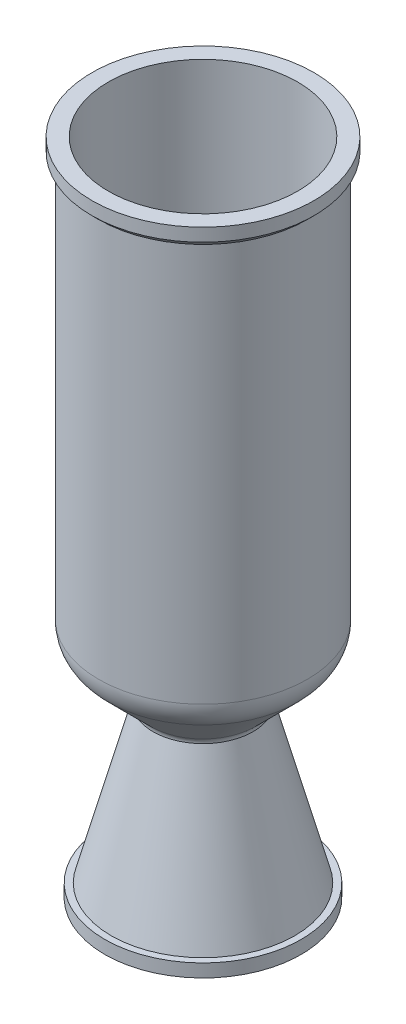
ISO-10303-21;
HEADER;
FILE_DESCRIPTION(('STEP AP214'),'2;1');
FILE_NAME('part.step','',(''),(''),'','','');
FILE_SCHEMA(('AUTOMOTIVE_DESIGN { 1 0 10303 214 1 1 1 1 }'));
ENDSEC;
DATA;
#1=APPLICATION_CONTEXT('core data for automotive mechanical design processes');
#2=APPLICATION_PROTOCOL_DEFINITION('international standard','automotive_design',2000,#1);
#3=PRODUCT_CONTEXT('',#1,'mechanical');
#4=PRODUCT('Part','Part','',(#3));
#5=PRODUCT_RELATED_PRODUCT_CATEGORY('part','',(#4));
#6=PRODUCT_DEFINITION_FORMATION('','',#4);
#7=PRODUCT_DEFINITION_CONTEXT('part definition',#1,'design');
#8=PRODUCT_DEFINITION('design','',#6,#7);
#9=PRODUCT_DEFINITION_SHAPE('','',#8);
#10=(LENGTH_UNIT() NAMED_UNIT(*) SI_UNIT(.MILLI.,.METRE.));
#11=(NAMED_UNIT(*) PLANE_ANGLE_UNIT() SI_UNIT($,.RADIAN.));
#12=(NAMED_UNIT(*) SI_UNIT($,.STERADIAN.) SOLID_ANGLE_UNIT());
#13=UNCERTAINTY_MEASURE_WITH_UNIT(LENGTH_MEASURE(1.E-05),#10,'distance_accuracy_value','');
#14=(GEOMETRIC_REPRESENTATION_CONTEXT(3) GLOBAL_UNCERTAINTY_ASSIGNED_CONTEXT((#13)) GLOBAL_UNIT_ASSIGNED_CONTEXT((#10,
#11,#12)) REPRESENTATION_CONTEXT('',''));
#15=CARTESIAN_POINT('',(0.,0.,0.));
#16=DIRECTION('',(0.,0.,1.));
#17=DIRECTION('',(1.,0.,0.));
#18=AXIS2_PLACEMENT_3D('',#15,#16,#17);
#19=CARTESIAN_POINT('',(-50.8,0.,0.));
#20=DIRECTION('',(0.,-1.,0.));
#21=DIRECTION('',(0.,0.,-1.));
#22=AXIS2_PLACEMENT_3D('',#19,#20,#21);
#23=PLANE('',#22);
#24=CARTESIAN_POINT('',(0.,0.,0.));
#25=DIRECTION('',(0.,-1.,0.));
#26=DIRECTION('',(0.,0.,-1.));
#27=AXIS2_PLACEMENT_3D('',#24,#25,#26);
#28=CIRCLE('',#27,53.975);
#29=CARTESIAN_POINT('',(0.,0.,-53.975));
#30=VERTEX_POINT('',#29);
#31=EDGE_CURVE('E10',#30,#30,#28,.T.);
#32=ORIENTED_EDGE('',*,*,#31,.F.);
#33=EDGE_LOOP('',(#32));
#34=FACE_BOUND('',#33,.T.);
#35=CARTESIAN_POINT('',(0.,0.,0.));
#36=DIRECTION('',(0.,-1.,0.));
#37=DIRECTION('',(0.,0.,-1.));
#38=AXIS2_PLACEMENT_3D('',#35,#36,#37);
#39=CIRCLE('',#38,46.0375);
#40=CARTESIAN_POINT('',(0.,0.,-46.0375));
#41=VERTEX_POINT('',#40);
#42=EDGE_CURVE('E92',#41,#41,#39,.T.);
#43=ORIENTED_EDGE('',*,*,#42,.T.);
#44=EDGE_LOOP('',(#43));
#45=FACE_BOUND('',#44,.T.);
#46=ADVANCED_FACE('F37',(#34,#45),#23,.F.);
#47=CARTESIAN_POINT('',(0.,0.,0.));
#48=DIRECTION('',(0.,-1.,0.));
#49=DIRECTION('',(0.,0.,-1.));
#50=AXIS2_PLACEMENT_3D('',#47,#48,#49);
#51=CYLINDRICAL_SURFACE('',#50,53.975);
#52=CARTESIAN_POINT('',(0.,-6.35,0.));
#53=DIRECTION('',(0.,-1.,0.));
#54=DIRECTION('',(0.,0.,-1.));
#55=AXIS2_PLACEMENT_3D('',#52,#53,#54);
#56=CIRCLE('',#55,53.975);
#57=CARTESIAN_POINT('',(0.,-6.35,-53.975));
#58=VERTEX_POINT('',#57);
#59=EDGE_CURVE('E43',#58,#58,#56,.T.);
#60=ORIENTED_EDGE('',*,*,#59,.F.);
#61=EDGE_LOOP('',(#60));
#62=FACE_BOUND('',#61,.T.);
#63=ORIENTED_EDGE('',*,*,#31,.T.);
#64=EDGE_LOOP('',(#63));
#65=FACE_BOUND('',#64,.T.);
#66=ADVANCED_FACE('F183',(#62,#65),#51,.T.);
#67=CARTESIAN_POINT('',(0.,-6.35,0.));
#68=DIRECTION('',(0.,1.,0.));
#69=DIRECTION('',(0.,0.,1.));
#70=AXIS2_PLACEMENT_3D('',#67,#68,#69);
#71=CONICAL_SURFACE('',#70,53.975,0.78539816339745);
#72=CARTESIAN_POINT('',(0.,-9.52499999999998,0.));
#73=DIRECTION('',(0.,-1.,0.));
#74=DIRECTION('',(0.,0.,-1.));
#75=AXIS2_PLACEMENT_3D('',#72,#73,#74);
#76=CIRCLE('',#75,50.8);
#77=CARTESIAN_POINT('',(0.,-9.52499999999998,-50.8));
#78=VERTEX_POINT('',#77);
#79=EDGE_CURVE('E47',#78,#78,#76,.T.);
#80=ORIENTED_EDGE('',*,*,#79,.F.);
#81=EDGE_LOOP('',(#80));
#82=FACE_BOUND('',#81,.T.);
#83=ORIENTED_EDGE('',*,*,#59,.T.);
#84=EDGE_LOOP('',(#83));
#85=FACE_BOUND('',#84,.T.);
#86=ADVANCED_FACE('F178',(#82,#85),#71,.T.);
#87=CARTESIAN_POINT('',(0.,0.,0.));
#88=DIRECTION('',(0.,-1.,0.));
#89=DIRECTION('',(0.,0.,-1.));
#90=AXIS2_PLACEMENT_3D('',#87,#88,#89);
#91=CYLINDRICAL_SURFACE('',#90,50.8);
#92=CARTESIAN_POINT('',(0.,-203.2,0.));
#93=DIRECTION('',(0.,-1.,0.));
#94=DIRECTION('',(0.,0.,-1.));
#95=AXIS2_PLACEMENT_3D('',#92,#93,#94);
#96=CIRCLE('',#95,50.8);
#97=CARTESIAN_POINT('',(0.,-203.2,-50.8));
#98=VERTEX_POINT('',#97);
#99=EDGE_CURVE('E51',#98,#98,#96,.T.);
#100=ORIENTED_EDGE('',*,*,#99,.F.);
#101=EDGE_LOOP('',(#100));
#102=FACE_BOUND('',#101,.T.);
#103=ORIENTED_EDGE('',*,*,#79,.T.);
#104=EDGE_LOOP('',(#103));
#105=FACE_BOUND('',#104,.T.);
#106=ADVANCED_FACE('F172',(#102,#105),#91,.T.);
#107=CARTESIAN_POINT('',(0.,-203.2,0.));
#108=DIRECTION('',(0.,-1.,0.));
#109=DIRECTION('',(0.,0.,-1.));
#110=AXIS2_PLACEMENT_3D('',#107,#108,#109);
#111=TOROIDAL_SURFACE('',#110,33.3375,17.4625);
#112=CARTESIAN_POINT('',(0.,-215.54785216647,0.));
#113=DIRECTION('',(0.,-1.,0.));
#114=DIRECTION('',(0.,0.,-1.));
#115=AXIS2_PLACEMENT_3D('',#112,#113,#114);
#116=CIRCLE('',#115,45.68535216647);
#117=CARTESIAN_POINT('',(0.,-215.54785216647,-45.68535216647));
#118=VERTEX_POINT('',#117);
#119=EDGE_CURVE('E56',#118,#118,#116,.T.);
#120=ORIENTED_EDGE('',*,*,#119,.F.);
#121=EDGE_LOOP('',(#120));
#122=FACE_BOUND('',#121,.T.);
#123=ORIENTED_EDGE('',*,*,#99,.T.);
#124=EDGE_LOOP('',(#123));
#125=FACE_BOUND('',#124,.T.);
#126=ADVANCED_FACE('F166',(#122,#125),#111,.T.);
#127=CARTESIAN_POINT('',(0.,-215.54785216647,0.));
#128=DIRECTION('',(0.,1.,0.));
#129=DIRECTION('',(0.,0.,1.));
#130=AXIS2_PLACEMENT_3D('',#127,#128,#129);
#131=CONICAL_SURFACE('',#130,45.68535216647,0.785398163397451);
#132=CARTESIAN_POINT('',(0.,-235.703787572287,0.));
#133=DIRECTION('',(0.,-1.,0.));
#134=DIRECTION('',(0.,0.,-1.));
#135=AXIS2_PLACEMENT_3D('',#132,#133,#134);
#136=CIRCLE('',#135,25.5294167606528);
#137=CARTESIAN_POINT('',(0.,-235.703787572287,-25.5294167606528));
#138=VERTEX_POINT('',#137);
#139=EDGE_CURVE('E59',#138,#138,#136,.T.);
#140=ORIENTED_EDGE('',*,*,#139,.F.);
#141=EDGE_LOOP('',(#140));
#142=FACE_BOUND('',#141,.T.);
#143=ORIENTED_EDGE('',*,*,#119,.T.);
#144=EDGE_LOOP('',(#143));
#145=FACE_BOUND('',#144,.T.);
#146=ADVANCED_FACE('F160',(#142,#145),#131,.T.);
#147=CARTESIAN_POINT('',(0.,-238.622370811635,0.));
#148=DIRECTION('',(0.,-1.,0.));
#149=DIRECTION('',(0.,0.,-1.));
#150=AXIS2_PLACEMENT_3D('',#147,#148,#149);
#151=TOROIDAL_SURFACE('',#150,28.4480000000006,4.12750000000044);
#152=CARTESIAN_POINT('',(0.,-238.50337483423,0.));
#153=DIRECTION('',(0.,-1.,0.));
#154=DIRECTION('',(0.,0.,-1.));
#155=AXIS2_PLACEMENT_3D('',#152,#153,#154);
#156=CIRCLE('',#155,24.3222156857926);
#157=CARTESIAN_POINT('',(0.,-238.50337483423,-24.3222156857926));
#158=VERTEX_POINT('',#157);
#159=EDGE_CURVE('E62',#158,#158,#156,.T.);
#160=ORIENTED_EDGE('',*,*,#159,.F.);
#161=EDGE_LOOP('',(#160));
#162=FACE_BOUND('',#161,.T.);
#163=ORIENTED_EDGE('',*,*,#139,.T.);
#164=EDGE_LOOP('',(#163));
#165=FACE_BOUND('',#164,.T.);
#166=ADVANCED_FACE('F154',(#162,#165),#151,.F.);
#167=CARTESIAN_POINT('',(0.,-238.50337483423,0.));
#168=DIRECTION('',(0.,-1.,0.));
#169=DIRECTION('',(0.,0.,-1.));
#170=AXIS2_PLACEMENT_3D('',#167,#168,#169);
#171=CONICAL_SURFACE('',#170,24.3222156857926,0.261799387799157);
#172=CARTESIAN_POINT('',(0.,-314.296884667974,0.));
#173=DIRECTION('',(0.,-1.,0.));
#174=DIRECTION('',(0.,0.,-1.));
#175=AXIS2_PLACEMENT_3D('',#172,#173,#174);
#176=CIRCLE('',#175,44.6310254372654);
#177=CARTESIAN_POINT('',(0.,-314.296884667974,-44.6310254372654));
#178=VERTEX_POINT('',#177);
#179=EDGE_CURVE('E65',#178,#178,#176,.T.);
#180=ORIENTED_EDGE('',*,*,#179,.F.);
#181=EDGE_LOOP('',(#180));
#182=FACE_BOUND('',#181,.T.);
#183=ORIENTED_EDGE('',*,*,#159,.T.);
#184=EDGE_LOOP('',(#183));
#185=FACE_BOUND('',#184,.T.);
#186=ADVANCED_FACE('F148',(#182,#185),#171,.T.);
#187=CARTESIAN_POINT('',(-47.752,-314.296884667974,0.));
#188=DIRECTION('',(0.,-1.,0.));
#189=DIRECTION('',(0.,0.,-1.));
#190=AXIS2_PLACEMENT_3D('',#187,#188,#189);
#191=PLANE('',#190);
#192=CARTESIAN_POINT('',(0.,-314.296884667974,0.));
#193=DIRECTION('',(0.,-1.,0.));
#194=DIRECTION('',(0.,0.,-1.));
#195=AXIS2_PLACEMENT_3D('',#192,#193,#194);
#196=CIRCLE('',#195,47.752);
#197=CARTESIAN_POINT('',(0.,-314.296884667974,-47.752));
#198=VERTEX_POINT('',#197);
#199=EDGE_CURVE('E68',#198,#198,#196,.T.);
#200=ORIENTED_EDGE('',*,*,#199,.F.);
#201=EDGE_LOOP('',(#200));
#202=FACE_BOUND('',#201,.T.);
#203=ORIENTED_EDGE('',*,*,#179,.T.);
#204=EDGE_LOOP('',(#203));
#205=FACE_BOUND('',#204,.T.);
#206=ADVANCED_FACE('F142',(#202,#205),#191,.F.);
#207=CARTESIAN_POINT('',(0.,0.,0.));
#208=DIRECTION('',(0.,-1.,0.));
#209=DIRECTION('',(0.,0.,-1.));
#210=AXIS2_PLACEMENT_3D('',#207,#208,#209);
#211=CYLINDRICAL_SURFACE('',#210,47.752);
#212=CARTESIAN_POINT('',(0.,-320.646884667974,0.));
#213=DIRECTION('',(0.,-1.,0.));
#214=DIRECTION('',(0.,0.,-1.));
#215=AXIS2_PLACEMENT_3D('',#212,#213,#214);
#216=CIRCLE('',#215,47.752);
#217=CARTESIAN_POINT('',(0.,-320.646884667974,-47.752));
#218=VERTEX_POINT('',#217);
#219=EDGE_CURVE('E71',#218,#218,#216,.T.);
#220=ORIENTED_EDGE('',*,*,#219,.F.);
#221=EDGE_LOOP('',(#220));
#222=FACE_BOUND('',#221,.T.);
#223=ORIENTED_EDGE('',*,*,#199,.T.);
#224=EDGE_LOOP('',(#223));
#225=FACE_BOUND('',#224,.T.);
#226=ADVANCED_FACE('F136',(#222,#225),#211,.T.);
#227=CARTESIAN_POINT('',(-41.402,-320.646884667974,0.));
#228=DIRECTION('',(0.,1.,0.));
#229=DIRECTION('',(0.,0.,1.));
#230=AXIS2_PLACEMENT_3D('',#227,#228,#229);
#231=PLANE('',#230);
#232=CARTESIAN_POINT('',(0.,-320.646884667974,0.));
#233=DIRECTION('',(0.,-1.,0.));
#234=DIRECTION('',(0.,0.,-1.));
#235=AXIS2_PLACEMENT_3D('',#232,#233,#234);
#236=CIRCLE('',#235,41.402);
#237=CARTESIAN_POINT('',(0.,-320.646884667974,-41.402));
#238=VERTEX_POINT('',#237);
#239=EDGE_CURVE('E74',#238,#238,#236,.T.);
#240=ORIENTED_EDGE('',*,*,#239,.F.);
#241=EDGE_LOOP('',(#240));
#242=FACE_BOUND('',#241,.T.);
#243=ORIENTED_EDGE('',*,*,#219,.T.);
#244=EDGE_LOOP('',(#243));
#245=FACE_BOUND('',#244,.T.);
#246=ADVANCED_FACE('F130',(#242,#245),#231,.F.);
#247=CARTESIAN_POINT('',(0.,-320.646884667974,0.));
#248=DIRECTION('',(0.,-1.,0.));
#249=DIRECTION('',(0.,0.,-1.));
#250=AXIS2_PLACEMENT_3D('',#247,#248,#249);
#251=CONICAL_SURFACE('',#250,41.402,0.261799387799157);
#252=CARTESIAN_POINT('',(0.,-239.608471373476,0.));
#253=DIRECTION('',(0.,-1.,0.));
#254=DIRECTION('',(0.,0.,-1.));
#255=AXIS2_PLACEMENT_3D('',#252,#253,#254);
#256=CIRCLE('',#255,19.6878226018389);
#257=CARTESIAN_POINT('',(0.,-239.608471373476,-19.6878226018389));
#258=VERTEX_POINT('',#257);
#259=EDGE_CURVE('E77',#258,#258,#256,.T.);
#260=ORIENTED_EDGE('',*,*,#259,.F.);
#261=EDGE_LOOP('',(#260));
#262=FACE_BOUND('',#261,.T.);
#263=ORIENTED_EDGE('',*,*,#239,.T.);
#264=EDGE_LOOP('',(#263));
#265=FACE_BOUND('',#264,.T.);
#266=ADVANCED_FACE('F124',(#262,#265),#251,.F.);
#267=CARTESIAN_POINT('',(0.,-238.622370811635,0.));
#268=DIRECTION('',(0.,-1.,0.));
#269=DIRECTION('',(0.,0.,-1.));
#270=AXIS2_PLACEMENT_3D('',#267,#268,#269);
#271=TOROIDAL_SURFACE('',#270,23.3679999999997,3.80999999999938);
#272=CARTESIAN_POINT('',(0.,-238.622370811635,0.));
#273=DIRECTION('',(0.,-1.,0.));
#274=DIRECTION('',(0.,0.,-1.));
#275=AXIS2_PLACEMENT_3D('',#272,#273,#274);
#276=CIRCLE('',#275,19.5580000000003);
#277=CARTESIAN_POINT('',(0.,-238.622370811635,-19.5580000000003));
#278=VERTEX_POINT('',#277);
#279=EDGE_CURVE('E80',#278,#278,#276,.T.);
#280=ORIENTED_EDGE('',*,*,#279,.F.);
#281=EDGE_LOOP('',(#280));
#282=FACE_BOUND('',#281,.T.);
#283=ORIENTED_EDGE('',*,*,#259,.T.);
#284=EDGE_LOOP('',(#283));
#285=FACE_BOUND('',#284,.T.);
#286=ADVANCED_FACE('F118',(#282,#285),#271,.T.);
#287=CARTESIAN_POINT('',(0.,-238.622370811635,0.));
#288=DIRECTION('',(0.,-1.,0.));
#289=DIRECTION('',(0.,0.,-1.));
#290=AXIS2_PLACEMENT_3D('',#287,#288,#289);
#291=TOROIDAL_SURFACE('',#290,28.4480000000006,8.89000000000033);
#292=CARTESIAN_POINT('',(0.,-232.336191526886,0.));
#293=DIRECTION('',(0.,-1.,0.));
#294=DIRECTION('',(0.,0.,-1.));
#295=AXIS2_PLACEMENT_3D('',#292,#293,#294);
#296=CIRCLE('',#295,22.1618207152519);
#297=CARTESIAN_POINT('',(0.,-232.336191526886,-22.1618207152519));
#298=VERTEX_POINT('',#297);
#299=EDGE_CURVE('E83',#298,#298,#296,.T.);
#300=ORIENTED_EDGE('',*,*,#299,.F.);
#301=EDGE_LOOP('',(#300));
#302=FACE_BOUND('',#301,.T.);
#303=ORIENTED_EDGE('',*,*,#279,.T.);
#304=EDGE_LOOP('',(#303));
#305=FACE_BOUND('',#304,.T.);
#306=ADVANCED_FACE('F112',(#302,#305),#291,.T.);
#307=CARTESIAN_POINT('',(0.,-232.336191526886,0.));
#308=DIRECTION('',(0.,1.,0.));
#309=DIRECTION('',(0.,0.,1.));
#310=AXIS2_PLACEMENT_3D('',#307,#308,#309);
#311=CONICAL_SURFACE('',#310,22.1618207152519,0.785398163397451);
#312=CARTESIAN_POINT('',(0.,-212.180256121069,0.));
#313=DIRECTION('',(0.,-1.,0.));
#314=DIRECTION('',(0.,0.,-1.));
#315=AXIS2_PLACEMENT_3D('',#312,#313,#314);
#316=CIRCLE('',#315,42.3177561210692);
#317=CARTESIAN_POINT('',(0.,-212.180256121069,-42.3177561210692));
#318=VERTEX_POINT('',#317);
#319=EDGE_CURVE('E86',#318,#318,#316,.T.);
#320=ORIENTED_EDGE('',*,*,#319,.F.);
#321=EDGE_LOOP('',(#320));
#322=FACE_BOUND('',#321,.T.);
#323=ORIENTED_EDGE('',*,*,#299,.T.);
#324=EDGE_LOOP('',(#323));
#325=FACE_BOUND('',#324,.T.);
#326=ADVANCED_FACE('F106',(#322,#325),#311,.F.);
#327=CARTESIAN_POINT('',(0.,-203.2,0.));
#328=DIRECTION('',(0.,-1.,0.));
#329=DIRECTION('',(0.,0.,-1.));
#330=AXIS2_PLACEMENT_3D('',#327,#328,#329);
#331=TOROIDAL_SURFACE('',#330,33.3375,12.7);
#332=CARTESIAN_POINT('',(0.,-203.2,0.));
#333=DIRECTION('',(0.,-1.,0.));
#334=DIRECTION('',(0.,0.,-1.));
#335=AXIS2_PLACEMENT_3D('',#332,#333,#334);
#336=CIRCLE('',#335,46.0375);
#337=CARTESIAN_POINT('',(0.,-203.2,-46.0375));
#338=VERTEX_POINT('',#337);
#339=EDGE_CURVE('E89',#338,#338,#336,.T.);
#340=ORIENTED_EDGE('',*,*,#339,.F.);
#341=EDGE_LOOP('',(#340));
#342=FACE_BOUND('',#341,.T.);
#343=ORIENTED_EDGE('',*,*,#319,.T.);
#344=EDGE_LOOP('',(#343));
#345=FACE_BOUND('',#344,.T.);
#346=ADVANCED_FACE('F100',(#342,#345),#331,.F.);
#347=CARTESIAN_POINT('',(0.,0.,0.));
#348=DIRECTION('',(0.,-1.,0.));
#349=DIRECTION('',(0.,0.,-1.));
#350=AXIS2_PLACEMENT_3D('',#347,#348,#349);
#351=CYLINDRICAL_SURFACE('',#350,46.0375);
#352=ORIENTED_EDGE('',*,*,#42,.F.);
#353=EDGE_LOOP('',(#352));
#354=FACE_BOUND('',#353,.T.);
#355=ORIENTED_EDGE('',*,*,#339,.T.);
#356=EDGE_LOOP('',(#355));
#357=FACE_BOUND('',#356,.T.);
#358=ADVANCED_FACE('F97',(#354,#357),#351,.F.);
#359=CLOSED_SHELL('',(#46,#66,#86,#106,#126,#146,#166,#186,#206,#226,#246,#266,#286,#306,#326,
#346,#358));
#360=MANIFOLD_SOLID_BREP('B2',#359);
#361=ADVANCED_BREP_SHAPE_REPRESENTATION('',(#18,#360),#14);
#362=SHAPE_DEFINITION_REPRESENTATION(#9,#361);
ENDSEC;
END-ISO-10303-21;
